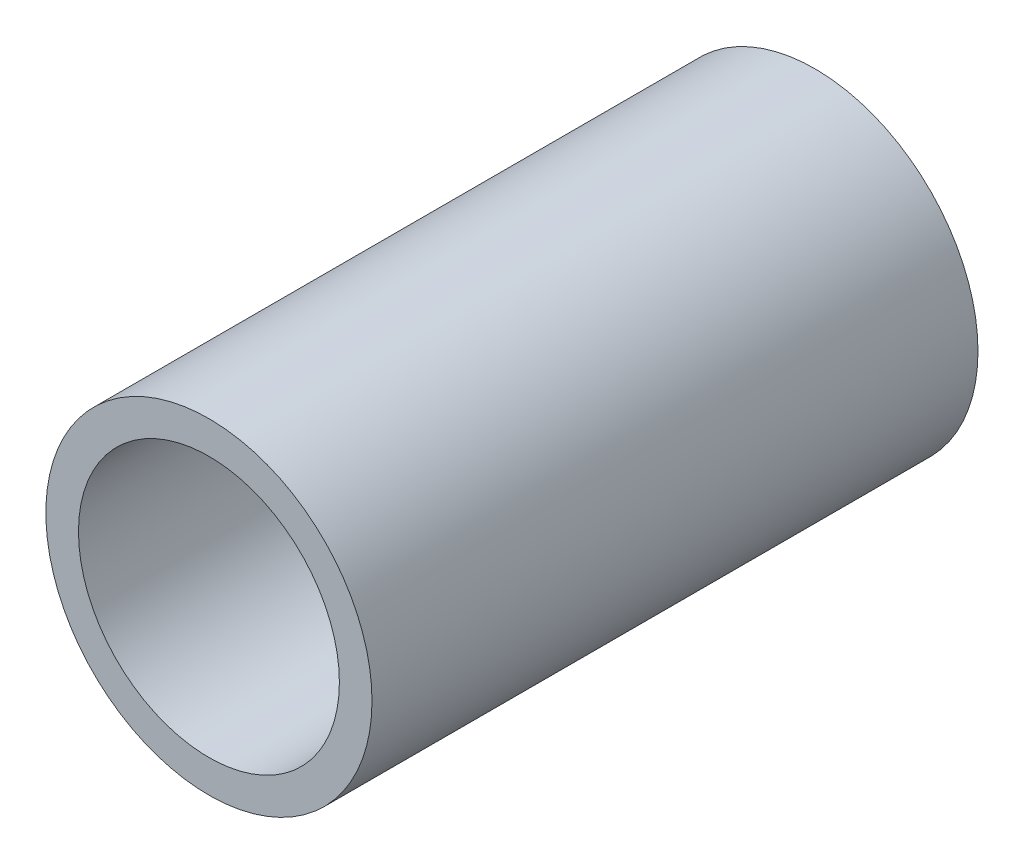
ISO-10303-21;
HEADER;
FILE_DESCRIPTION(('STEP AP214'),'2;1');
FILE_NAME('part.step','',(''),(''),'','','');
FILE_SCHEMA(('AUTOMOTIVE_DESIGN { 1 0 10303 214 1 1 1 1 }'));
ENDSEC;
DATA;
#1=APPLICATION_CONTEXT('core data for automotive mechanical design processes');
#2=APPLICATION_PROTOCOL_DEFINITION('international standard','automotive_design',2000,#1);
#3=PRODUCT_CONTEXT('',#1,'mechanical');
#4=PRODUCT('Part','Part','',(#3));
#5=PRODUCT_RELATED_PRODUCT_CATEGORY('part','',(#4));
#6=PRODUCT_DEFINITION_FORMATION('','',#4);
#7=PRODUCT_DEFINITION_CONTEXT('part definition',#1,'design');
#8=PRODUCT_DEFINITION('design','',#6,#7);
#9=PRODUCT_DEFINITION_SHAPE('','',#8);
#10=(LENGTH_UNIT() NAMED_UNIT(*) SI_UNIT(.MILLI.,.METRE.));
#11=(NAMED_UNIT(*) PLANE_ANGLE_UNIT() SI_UNIT($,.RADIAN.));
#12=(NAMED_UNIT(*) SI_UNIT($,.STERADIAN.) SOLID_ANGLE_UNIT());
#13=UNCERTAINTY_MEASURE_WITH_UNIT(LENGTH_MEASURE(1.E-05),#10,'distance_accuracy_value','');
#14=(GEOMETRIC_REPRESENTATION_CONTEXT(3) GLOBAL_UNCERTAINTY_ASSIGNED_CONTEXT((#13)) GLOBAL_UNIT_ASSIGNED_CONTEXT((#10,
#11,#12)) REPRESENTATION_CONTEXT('',''));
#15=CARTESIAN_POINT('',(0.,0.,0.));
#16=DIRECTION('',(0.,0.,1.));
#17=DIRECTION('',(1.,0.,0.));
#18=AXIS2_PLACEMENT_3D('',#15,#16,#17);
#19=CARTESIAN_POINT('',(0.,0.,4.645));
#20=DIRECTION('',(0.,0.,1.));
#21=DIRECTION('',(1.,0.,0.));
#22=AXIS2_PLACEMENT_3D('',#19,#20,#21);
#23=PLANE('',#22);
#24=CARTESIAN_POINT('',(0.,0.,4.645));
#25=DIRECTION('',(0.,0.,1.));
#26=DIRECTION('',(1.,0.,0.));
#27=AXIS2_PLACEMENT_3D('',#24,#25,#26);
#28=CIRCLE('',#27,1.25);
#29=CARTESIAN_POINT('',(1.25,0.,4.645));
#30=VERTEX_POINT('',#29);
#31=EDGE_CURVE('E10',#30,#30,#28,.T.);
#32=ORIENTED_EDGE('',*,*,#31,.T.);
#33=EDGE_LOOP('',(#32));
#34=FACE_BOUND('',#33,.T.);
#35=CARTESIAN_POINT('',(0.,0.,4.645));
#36=DIRECTION('',(0.,0.,1.));
#37=DIRECTION('',(1.,0.,0.));
#38=AXIS2_PLACEMENT_3D('',#35,#36,#37);
#39=CIRCLE('',#38,1.);
#40=CARTESIAN_POINT('',(1.,0.,4.645));
#41=VERTEX_POINT('',#40);
#42=EDGE_CURVE('E42',#41,#41,#39,.T.);
#43=ORIENTED_EDGE('',*,*,#42,.F.);
#44=EDGE_LOOP('',(#43));
#45=FACE_BOUND('',#44,.T.);
#46=ADVANCED_FACE('F31',(#34,#45),#23,.T.);
#47=CARTESIAN_POINT('',(0.,0.,0.));
#48=DIRECTION('',(0.,0.,1.));
#49=DIRECTION('',(1.,0.,0.));
#50=AXIS2_PLACEMENT_3D('',#47,#48,#49);
#51=PLANE('',#50);
#52=CARTESIAN_POINT('',(0.,0.,0.));
#53=DIRECTION('',(0.,0.,1.));
#54=DIRECTION('',(1.,0.,0.));
#55=AXIS2_PLACEMENT_3D('',#52,#53,#54);
#56=CIRCLE('',#55,1.25);
#57=CARTESIAN_POINT('',(1.25,0.,0.));
#58=VERTEX_POINT('',#57);
#59=EDGE_CURVE('E35',#58,#58,#56,.T.);
#60=ORIENTED_EDGE('',*,*,#59,.F.);
#61=EDGE_LOOP('',(#60));
#62=FACE_BOUND('',#61,.T.);
#63=CARTESIAN_POINT('',(0.,0.,0.));
#64=DIRECTION('',(0.,0.,1.));
#65=DIRECTION('',(1.,0.,0.));
#66=AXIS2_PLACEMENT_3D('',#63,#64,#65);
#67=CIRCLE('',#66,1.);
#68=CARTESIAN_POINT('',(1.,0.,0.));
#69=VERTEX_POINT('',#68);
#70=EDGE_CURVE('E44',#69,#69,#67,.T.);
#71=ORIENTED_EDGE('',*,*,#70,.T.);
#72=EDGE_LOOP('',(#71));
#73=FACE_BOUND('',#72,.T.);
#74=ADVANCED_FACE('F54',(#62,#73),#51,.F.);
#75=CARTESIAN_POINT('',(0.,0.,4.645));
#76=DIRECTION('',(0.,0.,-1.));
#77=DIRECTION('',(-1.,0.,0.));
#78=AXIS2_PLACEMENT_3D('',#75,#76,#77);
#79=CYLINDRICAL_SURFACE('',#78,1.25);
#80=ORIENTED_EDGE('',*,*,#31,.F.);
#81=EDGE_LOOP('',(#80));
#82=FACE_BOUND('',#81,.T.);
#83=ORIENTED_EDGE('',*,*,#59,.T.);
#84=EDGE_LOOP('',(#83));
#85=FACE_BOUND('',#84,.T.);
#86=ADVANCED_FACE('F33',(#82,#85),#79,.T.);
#87=CARTESIAN_POINT('',(0.,0.,4.645));
#88=DIRECTION('',(0.,0.,-1.));
#89=DIRECTION('',(-1.,0.,0.));
#90=AXIS2_PLACEMENT_3D('',#87,#88,#89);
#91=CYLINDRICAL_SURFACE('',#90,1.);
#92=ORIENTED_EDGE('',*,*,#42,.T.);
#93=EDGE_LOOP('',(#92));
#94=FACE_BOUND('',#93,.T.);
#95=ORIENTED_EDGE('',*,*,#70,.F.);
#96=EDGE_LOOP('',(#95));
#97=FACE_BOUND('',#96,.T.);
#98=ADVANCED_FACE('F50',(#94,#97),#91,.F.);
#99=CLOSED_SHELL('',(#46,#74,#86,#98));
#100=MANIFOLD_SOLID_BREP('B2',#99);
#101=ADVANCED_BREP_SHAPE_REPRESENTATION('',(#18,#100),#14);
#102=SHAPE_DEFINITION_REPRESENTATION(#9,#101);
ENDSEC;
END-ISO-10303-21;
